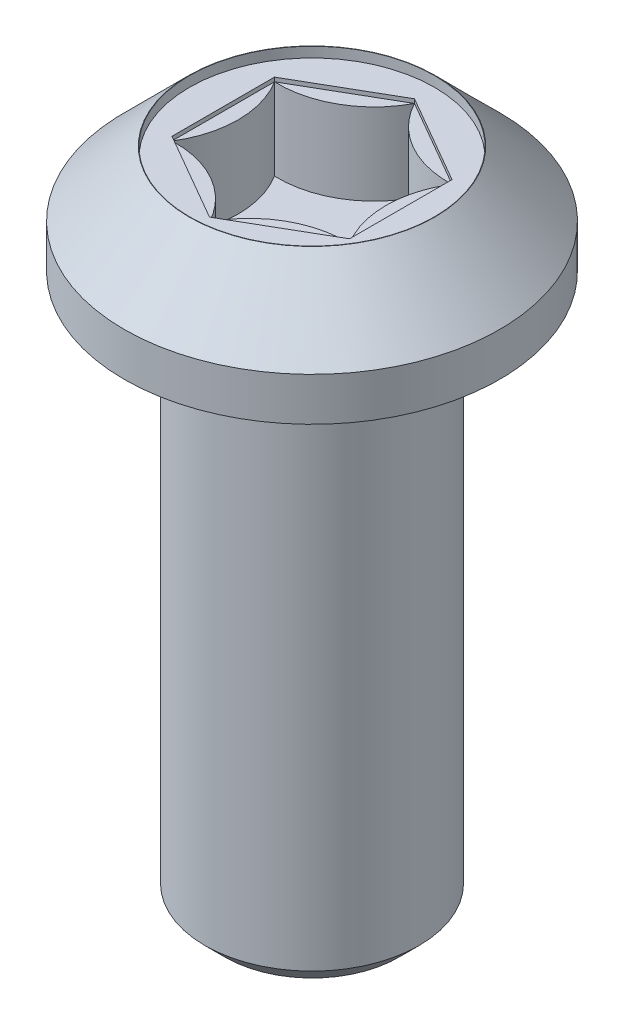
ISO-10303-21;
HEADER;
FILE_DESCRIPTION(('STEP AP214'),'2;1');
FILE_NAME('part.step','',(''),(''),'','','');
FILE_SCHEMA(('AUTOMOTIVE_DESIGN { 1 0 10303 214 1 1 1 1 }'));
ENDSEC;
DATA;
#1=APPLICATION_CONTEXT('core data for automotive mechanical design processes');
#2=APPLICATION_PROTOCOL_DEFINITION('international standard','automotive_design',2000,#1);
#3=PRODUCT_CONTEXT('',#1,'mechanical');
#4=PRODUCT('Part','Part','',(#3));
#5=PRODUCT_RELATED_PRODUCT_CATEGORY('part','',(#4));
#6=PRODUCT_DEFINITION_FORMATION('','',#4);
#7=PRODUCT_DEFINITION_CONTEXT('part definition',#1,'design');
#8=PRODUCT_DEFINITION('design','',#6,#7);
#9=PRODUCT_DEFINITION_SHAPE('','',#8);
#10=(LENGTH_UNIT() NAMED_UNIT(*) SI_UNIT(.MILLI.,.METRE.));
#11=(NAMED_UNIT(*) PLANE_ANGLE_UNIT() SI_UNIT($,.RADIAN.));
#12=(NAMED_UNIT(*) SI_UNIT($,.STERADIAN.) SOLID_ANGLE_UNIT());
#13=UNCERTAINTY_MEASURE_WITH_UNIT(LENGTH_MEASURE(1.E-05),#10,'distance_accuracy_value','');
#14=(GEOMETRIC_REPRESENTATION_CONTEXT(3) GLOBAL_UNCERTAINTY_ASSIGNED_CONTEXT((#13)) GLOBAL_UNIT_ASSIGNED_CONTEXT((#10,
#11,#12)) REPRESENTATION_CONTEXT('',''));
#15=CARTESIAN_POINT('',(0.,0.,0.));
#16=DIRECTION('',(0.,0.,1.));
#17=DIRECTION('',(1.,0.,0.));
#18=AXIS2_PLACEMENT_3D('',#15,#16,#17);
#19=CARTESIAN_POINT('',(4.175,27.6,-7.23131212160054));
#20=DIRECTION('',(0.,1.,0.));
#21=DIRECTION('',(0.,0.,1.));
#22=AXIS2_PLACEMENT_3D('',#19,#20,#21);
#23=CYLINDRICAL_SURFACE('',#22,4.72308162114541);
#24=CARTESIAN_POINT('',(4.175,31.6,-7.23131212160054));
#25=DIRECTION('',(0.,-1.,0.));
#26=DIRECTION('',(0.,0.,1.));
#27=AXIS2_PLACEMENT_3D('',#24,#25,#26);
#28=CIRCLE('',#27,4.72308162114541);
#29=CARTESIAN_POINT('',(4.35000000000035,31.6,-2.51147367097507));
#30=VERTEX_POINT('',#29);
#31=CARTESIAN_POINT('',(0.,31.6,-5.02294734195014));
#32=VERTEX_POINT('',#31);
#33=EDGE_CURVE('E127',#30,#32,#28,.T.);
#34=ORIENTED_EDGE('',*,*,#33,.T.);
#35=DIRECTION('',(0.,1.,0.));
#36=VECTOR('',#35,1.);
#37=CARTESIAN_POINT('',(0.,27.6,-5.02294734195014));
#38=LINE('',#37,#36);
#39=CARTESIAN_POINT('',(0.,27.6,-5.02294734195014));
#40=VERTEX_POINT('',#39);
#41=EDGE_CURVE('E126',#40,#32,#38,.T.);
#42=ORIENTED_EDGE('',*,*,#41,.F.);
#43=CARTESIAN_POINT('',(4.175,27.6,-7.23131212160054));
#44=DIRECTION('',(0.,-1.,0.));
#45=DIRECTION('',(0.,0.,1.));
#46=AXIS2_PLACEMENT_3D('',#43,#44,#45);
#47=CIRCLE('',#46,4.72308162114541);
#48=CARTESIAN_POINT('',(4.35000000000035,27.6,-2.51147367097507));
#49=VERTEX_POINT('',#48);
#50=EDGE_CURVE('E140',#49,#40,#47,.T.);
#51=ORIENTED_EDGE('',*,*,#50,.F.);
#52=DIRECTION('',(0.,1.,0.));
#53=VECTOR('',#52,1.);
#54=CARTESIAN_POINT('',(4.35000000000035,27.6,-2.51147367097507));
#55=LINE('',#54,#53);
#56=EDGE_CURVE('E40',#49,#30,#55,.T.);
#57=ORIENTED_EDGE('',*,*,#56,.T.);
#58=EDGE_LOOP('',(#34,#42,#51,#57));
#59=FACE_BOUND('',#58,.T.);
#60=ADVANCED_FACE('F16',(#59),#23,.T.);
#61=CARTESIAN_POINT('',(8.35000000000034,27.6,0.));
#62=DIRECTION('',(0.,1.,0.));
#63=DIRECTION('',(0.,0.,1.));
#64=AXIS2_PLACEMENT_3D('',#61,#62,#63);
#65=CYLINDRICAL_SURFACE('',#64,4.72308162114535);
#66=CARTESIAN_POINT('',(8.35000000000034,31.6,0.));
#67=DIRECTION('',(0.,-1.,0.));
#68=DIRECTION('',(0.,0.,1.));
#69=AXIS2_PLACEMENT_3D('',#66,#67,#68);
#70=CIRCLE('',#69,4.72308162114535);
#71=CARTESIAN_POINT('',(4.35000000000035,31.6,2.51147367097507));
#72=VERTEX_POINT('',#71);
#73=EDGE_CURVE('E138',#72,#30,#70,.T.);
#74=ORIENTED_EDGE('',*,*,#73,.T.);
#75=ORIENTED_EDGE('',*,*,#56,.F.);
#76=CARTESIAN_POINT('',(8.35000000000034,27.6,0.));
#77=DIRECTION('',(0.,-1.,0.));
#78=DIRECTION('',(0.,0.,1.));
#79=AXIS2_PLACEMENT_3D('',#76,#77,#78);
#80=CIRCLE('',#79,4.72308162114535);
#81=CARTESIAN_POINT('',(4.35000000000035,27.6,2.51147367097508));
#82=VERTEX_POINT('',#81);
#83=EDGE_CURVE('E113',#82,#49,#80,.T.);
#84=ORIENTED_EDGE('',*,*,#83,.F.);
#85=DIRECTION('',(0.,1.,0.));
#86=VECTOR('',#85,1.);
#87=CARTESIAN_POINT('',(4.35000000000035,27.6,2.51147367097508));
#88=LINE('',#87,#86);
#89=EDGE_CURVE('E104',#82,#72,#88,.T.);
#90=ORIENTED_EDGE('',*,*,#89,.T.);
#91=EDGE_LOOP('',(#74,#75,#84,#90));
#92=FACE_BOUND('',#91,.T.);
#93=ADVANCED_FACE('F187',(#92),#65,.T.);
#94=CARTESIAN_POINT('',(4.17500000000017,27.6,7.23131212160036));
#95=DIRECTION('',(0.,1.,0.));
#96=DIRECTION('',(0.,0.,1.));
#97=AXIS2_PLACEMENT_3D('',#94,#95,#96);
#98=CYLINDRICAL_SURFACE('',#97,4.72308162114535);
#99=CARTESIAN_POINT('',(4.17500000000017,31.6,7.23131212160036));
#100=DIRECTION('',(0.,-1.,0.));
#101=DIRECTION('',(0.,0.,1.));
#102=AXIS2_PLACEMENT_3D('',#99,#100,#101);
#103=CIRCLE('',#102,4.72308162114535);
#104=CARTESIAN_POINT('',(0.,31.6,5.02294734195014));
#105=VERTEX_POINT('',#104);
#106=EDGE_CURVE('E136',#105,#72,#103,.T.);
#107=ORIENTED_EDGE('',*,*,#106,.T.);
#108=ORIENTED_EDGE('',*,*,#89,.F.);
#109=CARTESIAN_POINT('',(4.17500000000017,27.6,7.23131212160036));
#110=DIRECTION('',(0.,-1.,0.));
#111=DIRECTION('',(0.,0.,1.));
#112=AXIS2_PLACEMENT_3D('',#109,#110,#111);
#113=CIRCLE('',#112,4.72308162114535);
#114=CARTESIAN_POINT('',(0.,27.6,5.02294734195014));
#115=VERTEX_POINT('',#114);
#116=EDGE_CURVE('E108',#115,#82,#113,.T.);
#117=ORIENTED_EDGE('',*,*,#116,.F.);
#118=DIRECTION('',(0.,1.,0.));
#119=VECTOR('',#118,1.);
#120=CARTESIAN_POINT('',(0.,27.6,5.02294734195014));
#121=LINE('',#120,#119);
#122=EDGE_CURVE('E92',#115,#105,#121,.T.);
#123=ORIENTED_EDGE('',*,*,#122,.T.);
#124=EDGE_LOOP('',(#107,#108,#117,#123));
#125=FACE_BOUND('',#124,.T.);
#126=ADVANCED_FACE('F109',(#125),#98,.T.);
#127=CARTESIAN_POINT('',(-4.17500000000017,27.6,7.23131212160036));
#128=DIRECTION('',(0.,1.,0.));
#129=DIRECTION('',(0.,0.,1.));
#130=AXIS2_PLACEMENT_3D('',#127,#128,#129);
#131=CYLINDRICAL_SURFACE('',#130,4.72308162114535);
#132=CARTESIAN_POINT('',(-4.17500000000017,31.6,7.23131212160036));
#133=DIRECTION('',(0.,-1.,0.));
#134=DIRECTION('',(0.,0.,1.));
#135=AXIS2_PLACEMENT_3D('',#132,#133,#134);
#136=CIRCLE('',#135,4.72308162114535);
#137=CARTESIAN_POINT('',(-4.35000000000034,31.6,2.51147367097507));
#138=VERTEX_POINT('',#137);
#139=EDGE_CURVE('E101',#138,#105,#136,.T.);
#140=ORIENTED_EDGE('',*,*,#139,.T.);
#141=ORIENTED_EDGE('',*,*,#122,.F.);
#142=CARTESIAN_POINT('',(-4.17500000000017,27.6,7.23131212160036));
#143=DIRECTION('',(0.,-1.,0.));
#144=DIRECTION('',(0.,0.,1.));
#145=AXIS2_PLACEMENT_3D('',#142,#143,#144);
#146=CIRCLE('',#145,4.72308162114535);
#147=CARTESIAN_POINT('',(-4.35000000000034,27.6,2.51147367097507));
#148=VERTEX_POINT('',#147);
#149=EDGE_CURVE('E97',#148,#115,#146,.T.);
#150=ORIENTED_EDGE('',*,*,#149,.F.);
#151=DIRECTION('',(0.,1.,0.));
#152=VECTOR('',#151,1.);
#153=CARTESIAN_POINT('',(-4.35000000000034,27.6,2.51147367097507));
#154=LINE('',#153,#152);
#155=EDGE_CURVE('E105',#148,#138,#154,.T.);
#156=ORIENTED_EDGE('',*,*,#155,.T.);
#157=EDGE_LOOP('',(#140,#141,#150,#156));
#158=FACE_BOUND('',#157,.T.);
#159=ADVANCED_FACE('F94',(#158),#131,.T.);
#160=CARTESIAN_POINT('',(-8.35000000000034,27.6,0.));
#161=DIRECTION('',(0.,1.,0.));
#162=DIRECTION('',(0.,0.,1.));
#163=AXIS2_PLACEMENT_3D('',#160,#161,#162);
#164=CYLINDRICAL_SURFACE('',#163,4.72308162114535);
#165=CARTESIAN_POINT('',(-8.35000000000034,31.6,0.));
#166=DIRECTION('',(0.,-1.,0.));
#167=DIRECTION('',(0.,0.,1.));
#168=AXIS2_PLACEMENT_3D('',#165,#166,#167);
#169=CIRCLE('',#168,4.72308162114535);
#170=CARTESIAN_POINT('',(-4.35000000000035,31.6,-2.51147367097507));
#171=VERTEX_POINT('',#170);
#172=EDGE_CURVE('E132',#171,#138,#169,.T.);
#173=ORIENTED_EDGE('',*,*,#172,.T.);
#174=ORIENTED_EDGE('',*,*,#155,.F.);
#175=CARTESIAN_POINT('',(-8.35000000000034,27.6,0.));
#176=DIRECTION('',(0.,-1.,0.));
#177=DIRECTION('',(0.,0.,1.));
#178=AXIS2_PLACEMENT_3D('',#175,#176,#177);
#179=CIRCLE('',#178,4.72308162114535);
#180=CARTESIAN_POINT('',(-4.35000000000035,27.6,-2.51147367097507));
#181=VERTEX_POINT('',#180);
#182=EDGE_CURVE('E119',#181,#148,#179,.T.);
#183=ORIENTED_EDGE('',*,*,#182,.F.);
#184=DIRECTION('',(0.,1.,0.));
#185=VECTOR('',#184,1.);
#186=CARTESIAN_POINT('',(-4.35000000000035,27.6,-2.51147367097507));
#187=LINE('',#186,#185);
#188=EDGE_CURVE('E145',#181,#171,#187,.T.);
#189=ORIENTED_EDGE('',*,*,#188,.T.);
#190=EDGE_LOOP('',(#173,#174,#183,#189));
#191=FACE_BOUND('',#190,.T.);
#192=ADVANCED_FACE('F422',(#191),#164,.T.);
#193=CARTESIAN_POINT('',(-4.17500000000017,27.6,-7.23131212160036));
#194=DIRECTION('',(0.,1.,0.));
#195=DIRECTION('',(0.,0.,1.));
#196=AXIS2_PLACEMENT_3D('',#193,#194,#195);
#197=CYLINDRICAL_SURFACE('',#196,4.72308162114535);
#198=CARTESIAN_POINT('',(-4.17500000000017,31.6,-7.23131212160036));
#199=DIRECTION('',(0.,-1.,0.));
#200=DIRECTION('',(0.,0.,1.));
#201=AXIS2_PLACEMENT_3D('',#198,#199,#200);
#202=CIRCLE('',#201,4.72308162114535);
#203=EDGE_CURVE('E61',#32,#171,#202,.T.);
#204=ORIENTED_EDGE('',*,*,#203,.T.);
#205=ORIENTED_EDGE('',*,*,#188,.F.);
#206=CARTESIAN_POINT('',(-4.17500000000017,27.6,-7.23131212160036));
#207=DIRECTION('',(0.,-1.,0.));
#208=DIRECTION('',(0.,0.,1.));
#209=AXIS2_PLACEMENT_3D('',#206,#207,#208);
#210=CIRCLE('',#209,4.72308162114535);
#211=EDGE_CURVE('E121',#40,#181,#210,.T.);
#212=ORIENTED_EDGE('',*,*,#211,.F.);
#213=ORIENTED_EDGE('',*,*,#41,.T.);
#214=EDGE_LOOP('',(#204,#205,#212,#213));
#215=FACE_BOUND('',#214,.T.);
#216=ADVANCED_FACE('F197',(#215),#197,.T.);
#217=CARTESIAN_POINT('',(6.26250000000017,27.6,-3.61565606080027));
#218=DIRECTION('',(0.,1.,0.));
#219=DIRECTION('',(0.,0.,1.));
#220=AXIS2_PLACEMENT_3D('',#217,#218,#219);
#221=PLANE('',#220);
#222=ORIENTED_EDGE('',*,*,#50,.T.);
#223=ORIENTED_EDGE('',*,*,#211,.T.);
#224=ORIENTED_EDGE('',*,*,#182,.T.);
#225=ORIENTED_EDGE('',*,*,#149,.T.);
#226=ORIENTED_EDGE('',*,*,#116,.T.);
#227=ORIENTED_EDGE('',*,*,#83,.T.);
#228=EDGE_LOOP('',(#222,#223,#224,#225,#226,#227));
#229=FACE_BOUND('',#228,.T.);
#230=ADVANCED_FACE('F116',(#229),#221,.T.);
#231=CARTESIAN_POINT('',(0.,31.6,0.));
#232=DIRECTION('',(0.,1.,0.));
#233=DIRECTION('',(0.,0.,1.));
#234=AXIS2_PLACEMENT_3D('',#231,#232,#233);
#235=PLANE('',#234);
#236=DIRECTION('',(-0.866025403784439,0.,-0.5));
#237=VECTOR('',#236,1.);
#238=CARTESIAN_POINT('',(4.35000000000035,31.6,-2.51147367097507));
#239=LINE('',#238,#237);
#240=EDGE_CURVE('E481',#30,#32,#239,.T.);
#241=ORIENTED_EDGE('',*,*,#240,.T.);
#242=ORIENTED_EDGE('',*,*,#33,.F.);
#243=EDGE_LOOP('',(#241,#242));
#244=FACE_BOUND('',#243,.T.);
#245=ADVANCED_FACE('F317',(#244),#235,.T.);
#246=DIRECTION('',(0.,0.,-1.));
#247=VECTOR('',#246,1.);
#248=CARTESIAN_POINT('',(4.35000000000035,31.6,2.51147367097507));
#249=LINE('',#248,#247);
#250=EDGE_CURVE('E478',#72,#30,#249,.T.);
#251=ORIENTED_EDGE('',*,*,#250,.T.);
#252=ORIENTED_EDGE('',*,*,#73,.F.);
#253=EDGE_LOOP('',(#251,#252));
#254=FACE_BOUND('',#253,.T.);
#255=ADVANCED_FACE('F392',(#254),#235,.T.);
#256=DIRECTION('',(0.866025403784439,0.,-0.5));
#257=VECTOR('',#256,1.);
#258=CARTESIAN_POINT('',(0.,31.6,5.02294734195014));
#259=LINE('',#258,#257);
#260=EDGE_CURVE('E470',#105,#72,#259,.T.);
#261=ORIENTED_EDGE('',*,*,#260,.T.);
#262=ORIENTED_EDGE('',*,*,#106,.F.);
#263=EDGE_LOOP('',(#261,#262));
#264=FACE_BOUND('',#263,.T.);
#265=ADVANCED_FACE('F384',(#264),#235,.T.);
#266=DIRECTION('',(0.866025403784439,0.,0.5));
#267=VECTOR('',#266,1.);
#268=CARTESIAN_POINT('',(-4.35000000000034,31.6,2.51147367097507));
#269=LINE('',#268,#267);
#270=EDGE_CURVE('E466',#138,#105,#269,.T.);
#271=ORIENTED_EDGE('',*,*,#270,.T.);
#272=ORIENTED_EDGE('',*,*,#139,.F.);
#273=EDGE_LOOP('',(#271,#272));
#274=FACE_BOUND('',#273,.T.);
#275=ADVANCED_FACE('F376',(#274),#235,.T.);
#276=DIRECTION('',(0.,0.,1.));
#277=VECTOR('',#276,1.);
#278=CARTESIAN_POINT('',(-4.35000000000035,31.6,-2.51147367097507));
#279=LINE('',#278,#277);
#280=EDGE_CURVE('E464',#171,#138,#279,.T.);
#281=ORIENTED_EDGE('',*,*,#280,.T.);
#282=ORIENTED_EDGE('',*,*,#172,.F.);
#283=EDGE_LOOP('',(#281,#282));
#284=FACE_BOUND('',#283,.T.);
#285=ADVANCED_FACE('F318',(#284),#235,.T.);
#286=CARTESIAN_POINT('',(-4.35000000000035,31.6,-2.51147367097507));
#287=DIRECTION('',(-1.,0.,0.));
#288=DIRECTION('',(0.,0.,1.));
#289=AXIS2_PLACEMENT_3D('',#286,#287,#288);
#290=PLANE('',#289);
#291=DIRECTION('',(0.,0.,1.));
#292=VECTOR('',#291,1.);
#293=CARTESIAN_POINT('',(-4.35000000000035,31.8,-2.51147367097507));
#294=LINE('',#293,#292);
#295=CARTESIAN_POINT('',(-4.35000000000035,31.8,-2.51147367097507));
#296=VERTEX_POINT('',#295);
#297=CARTESIAN_POINT('',(-4.35000000000034,31.8,2.51147367097507));
#298=VERTEX_POINT('',#297);
#299=EDGE_CURVE('E31',#296,#298,#294,.T.);
#300=ORIENTED_EDGE('',*,*,#299,.T.);
#301=DIRECTION('',(0.,1.,0.));
#302=VECTOR('',#301,1.);
#303=CARTESIAN_POINT('',(-4.35000000000034,31.6,2.51147367097507));
#304=LINE('',#303,#302);
#305=EDGE_CURVE('E485',#138,#298,#304,.T.);
#306=ORIENTED_EDGE('',*,*,#305,.F.);
#307=ORIENTED_EDGE('',*,*,#280,.F.);
#308=DIRECTION('',(0.,1.,0.));
#309=VECTOR('',#308,1.);
#310=CARTESIAN_POINT('',(-4.35000000000035,31.6,-2.51147367097507));
#311=LINE('',#310,#309);
#312=EDGE_CURVE('E130',#171,#296,#311,.T.);
#313=ORIENTED_EDGE('',*,*,#312,.T.);
#314=EDGE_LOOP('',(#300,#306,#307,#313));
#315=FACE_BOUND('',#314,.T.);
#316=ADVANCED_FACE('F360',(#315),#290,.F.);
#317=CARTESIAN_POINT('',(0.,31.6,-5.02294734195014));
#318=DIRECTION('',(-0.499999999999999,0.,-0.866025403784439));
#319=DIRECTION('',(-0.866025403784439,0.,0.499999999999999));
#320=AXIS2_PLACEMENT_3D('',#317,#318,#319);
#321=PLANE('',#320);
#322=DIRECTION('',(-0.866025403784439,0.,0.499999999999999));
#323=VECTOR('',#322,1.);
#324=CARTESIAN_POINT('',(0.,31.8,-5.02294734195014));
#325=LINE('',#324,#323);
#326=CARTESIAN_POINT('',(0.,31.8,-5.02294734195014));
#327=VERTEX_POINT('',#326);
#328=EDGE_CURVE('E467',#327,#296,#325,.T.);
#329=ORIENTED_EDGE('',*,*,#328,.T.);
#330=ORIENTED_EDGE('',*,*,#312,.F.);
#331=DIRECTION('',(-0.866025403784439,0.,0.499999999999999));
#332=VECTOR('',#331,1.);
#333=CARTESIAN_POINT('',(0.,31.6,-5.02294734195014));
#334=LINE('',#333,#332);
#335=EDGE_CURVE('E53',#32,#171,#334,.T.);
#336=ORIENTED_EDGE('',*,*,#335,.F.);
#337=DIRECTION('',(0.,1.,0.));
#338=VECTOR('',#337,1.);
#339=CARTESIAN_POINT('',(0.,31.6,-5.02294734195014));
#340=LINE('',#339,#338);
#341=EDGE_CURVE('E499',#32,#327,#340,.T.);
#342=ORIENTED_EDGE('',*,*,#341,.T.);
#343=EDGE_LOOP('',(#329,#330,#336,#342));
#344=FACE_BOUND('',#343,.T.);
#345=ADVANCED_FACE('F351',(#344),#321,.F.);
#346=CARTESIAN_POINT('',(4.35000000000035,31.6,-2.51147367097507));
#347=DIRECTION('',(0.5,0.,-0.866025403784439));
#348=DIRECTION('',(-0.866025403784439,0.,-0.5));
#349=AXIS2_PLACEMENT_3D('',#346,#347,#348);
#350=PLANE('',#349);
#351=DIRECTION('',(-0.866025403784439,0.,-0.5));
#352=VECTOR('',#351,1.);
#353=CARTESIAN_POINT('',(4.35000000000035,31.8,-2.51147367097507));
#354=LINE('',#353,#352);
#355=CARTESIAN_POINT('',(4.35000000000035,31.8,-2.51147367097507));
#356=VERTEX_POINT('',#355);
#357=EDGE_CURVE('E473',#356,#327,#354,.T.);
#358=ORIENTED_EDGE('',*,*,#357,.T.);
#359=ORIENTED_EDGE('',*,*,#341,.F.);
#360=ORIENTED_EDGE('',*,*,#240,.F.);
#361=DIRECTION('',(0.,1.,0.));
#362=VECTOR('',#361,1.);
#363=CARTESIAN_POINT('',(4.35000000000035,31.6,-2.51147367097507));
#364=LINE('',#363,#362);
#365=EDGE_CURVE('E501',#30,#356,#364,.T.);
#366=ORIENTED_EDGE('',*,*,#365,.T.);
#367=EDGE_LOOP('',(#358,#359,#360,#366));
#368=FACE_BOUND('',#367,.T.);
#369=ADVANCED_FACE('F342',(#368),#350,.F.);
#370=CARTESIAN_POINT('',(4.35000000000035,31.6,2.51147367097507));
#371=DIRECTION('',(1.,0.,0.));
#372=DIRECTION('',(0.,0.,-1.));
#373=AXIS2_PLACEMENT_3D('',#370,#371,#372);
#374=PLANE('',#373);
#375=DIRECTION('',(0.,0.,-1.));
#376=VECTOR('',#375,1.);
#377=CARTESIAN_POINT('',(4.35000000000035,31.8,2.51147367097507));
#378=LINE('',#377,#376);
#379=CARTESIAN_POINT('',(4.35000000000035,31.8,2.51147367097507));
#380=VERTEX_POINT('',#379);
#381=EDGE_CURVE('E493',#380,#356,#378,.T.);
#382=ORIENTED_EDGE('',*,*,#381,.T.);
#383=ORIENTED_EDGE('',*,*,#365,.F.);
#384=ORIENTED_EDGE('',*,*,#250,.F.);
#385=DIRECTION('',(0.,1.,0.));
#386=VECTOR('',#385,1.);
#387=CARTESIAN_POINT('',(4.35000000000035,31.6,2.51147367097507));
#388=LINE('',#387,#386);
#389=EDGE_CURVE('E503',#72,#380,#388,.T.);
#390=ORIENTED_EDGE('',*,*,#389,.T.);
#391=EDGE_LOOP('',(#382,#383,#384,#390));
#392=FACE_BOUND('',#391,.T.);
#393=ADVANCED_FACE('F333',(#392),#374,.F.);
#394=CARTESIAN_POINT('',(0.,31.6,5.02294734195014));
#395=DIRECTION('',(0.5,0.,0.866025403784439));
#396=DIRECTION('',(0.866025403784439,0.,-0.5));
#397=AXIS2_PLACEMENT_3D('',#394,#395,#396);
#398=PLANE('',#397);
#399=DIRECTION('',(0.866025403784439,0.,-0.5));
#400=VECTOR('',#399,1.);
#401=CARTESIAN_POINT('',(0.,31.8,5.02294734195014));
#402=LINE('',#401,#400);
#403=CARTESIAN_POINT('',(0.,31.8,5.02294734195014));
#404=VERTEX_POINT('',#403);
#405=EDGE_CURVE('E490',#404,#380,#402,.T.);
#406=ORIENTED_EDGE('',*,*,#405,.T.);
#407=ORIENTED_EDGE('',*,*,#389,.F.);
#408=ORIENTED_EDGE('',*,*,#260,.F.);
#409=DIRECTION('',(0.,1.,0.));
#410=VECTOR('',#409,1.);
#411=CARTESIAN_POINT('',(0.,31.6,5.02294734195014));
#412=LINE('',#411,#410);
#413=EDGE_CURVE('E505',#105,#404,#412,.T.);
#414=ORIENTED_EDGE('',*,*,#413,.T.);
#415=EDGE_LOOP('',(#406,#407,#408,#414));
#416=FACE_BOUND('',#415,.T.);
#417=ADVANCED_FACE('F324',(#416),#398,.F.);
#418=CARTESIAN_POINT('',(-4.35000000000034,31.6,2.51147367097507));
#419=DIRECTION('',(-0.5,0.,0.866025403784439));
#420=DIRECTION('',(0.866025403784439,0.,0.5));
#421=AXIS2_PLACEMENT_3D('',#418,#419,#420);
#422=PLANE('',#421);
#423=DIRECTION('',(0.866025403784439,0.,0.5));
#424=VECTOR('',#423,1.);
#425=CARTESIAN_POINT('',(-4.35000000000034,31.8,2.51147367097507));
#426=LINE('',#425,#424);
#427=EDGE_CURVE('E487',#298,#404,#426,.T.);
#428=ORIENTED_EDGE('',*,*,#427,.T.);
#429=ORIENTED_EDGE('',*,*,#413,.F.);
#430=ORIENTED_EDGE('',*,*,#270,.F.);
#431=ORIENTED_EDGE('',*,*,#305,.T.);
#432=EDGE_LOOP('',(#428,#429,#430,#431));
#433=FACE_BOUND('',#432,.T.);
#434=ADVANCED_FACE('F315',(#433),#422,.F.);
#435=ORIENTED_EDGE('',*,*,#335,.T.);
#436=ORIENTED_EDGE('',*,*,#203,.F.);
#437=EDGE_LOOP('',(#435,#436));
#438=FACE_BOUND('',#437,.T.);
#439=ADVANCED_FACE('F225',(#438),#235,.T.);
#440=CARTESIAN_POINT('',(0.,27.,0.));
#441=DIRECTION('',(0.,-1.,0.));
#442=DIRECTION('',(0.,0.,-1.));
#443=AXIS2_PLACEMENT_3D('',#440,#441,#442);
#444=CYLINDRICAL_SURFACE('',#443,5.25);
#445=CARTESIAN_POINT('',(0.,1.00000000000001,0.));
#446=DIRECTION('',(0.,1.,0.));
#447=DIRECTION('',(0.,0.,1.));
#448=AXIS2_PLACEMENT_3D('',#445,#446,#447);
#449=CIRCLE('',#448,5.25);
#450=CARTESIAN_POINT('',(0.,1.00000000000001,5.25));
#451=VERTEX_POINT('',#450);
#452=EDGE_CURVE('E24',#451,#451,#449,.T.);
#453=ORIENTED_EDGE('',*,*,#452,.T.);
#454=EDGE_LOOP('',(#453));
#455=FACE_BOUND('',#454,.T.);
#456=CARTESIAN_POINT('',(0.,26.,0.));
#457=DIRECTION('',(0.,1.,0.));
#458=DIRECTION('',(0.,0.,1.));
#459=AXIS2_PLACEMENT_3D('',#456,#457,#458);
#460=CIRCLE('',#459,5.25);
#461=CARTESIAN_POINT('',(0.,26.,5.25));
#462=VERTEX_POINT('',#461);
#463=EDGE_CURVE('E161',#462,#462,#460,.F.);
#464=ORIENTED_EDGE('',*,*,#463,.T.);
#465=EDGE_LOOP('',(#464));
#466=FACE_BOUND('',#465,.T.);
#467=ADVANCED_FACE('F172',(#455,#466),#444,.T.);
#468=CARTESIAN_POINT('',(0.,0.,0.));
#469=DIRECTION('',(0.,1.,0.));
#470=DIRECTION('',(0.,0.,1.));
#471=AXIS2_PLACEMENT_3D('',#468,#469,#470);
#472=PLANE('',#471);
#473=CARTESIAN_POINT('',(0.,0.,0.));
#474=DIRECTION('',(0.,1.,0.));
#475=DIRECTION('',(0.,0.,1.));
#476=AXIS2_PLACEMENT_3D('',#473,#474,#475);
#477=CIRCLE('',#476,4.24999999999999);
#478=CARTESIAN_POINT('',(0.,0.,4.24999999999999));
#479=VERTEX_POINT('',#478);
#480=EDGE_CURVE('E10',#479,#479,#477,.F.);
#481=ORIENTED_EDGE('',*,*,#480,.T.);
#482=EDGE_LOOP('',(#481));
#483=FACE_BOUND('',#482,.T.);
#484=ADVANCED_FACE('F215',(#483),#472,.F.);
#485=CARTESIAN_POINT('',(0.,27.,0.));
#486=DIRECTION('',(0.,1.,0.));
#487=DIRECTION('',(0.,0.,1.));
#488=AXIS2_PLACEMENT_3D('',#485,#486,#487);
#489=PLANE('',#488);
#490=CARTESIAN_POINT('',(0.,27.,0.));
#491=DIRECTION('',(0.,1.,0.));
#492=DIRECTION('',(0.,0.,1.));
#493=AXIS2_PLACEMENT_3D('',#490,#491,#492);
#494=CIRCLE('',#493,6.25);
#495=CARTESIAN_POINT('',(0.,27.,6.25));
#496=VERTEX_POINT('',#495);
#497=EDGE_CURVE('E158',#496,#496,#494,.T.);
#498=ORIENTED_EDGE('',*,*,#497,.T.);
#499=EDGE_LOOP('',(#498));
#500=FACE_BOUND('',#499,.T.);
#501=CARTESIAN_POINT('',(0.,27.,0.));
#502=DIRECTION('',(0.,1.,0.));
#503=DIRECTION('',(0.,0.,1.));
#504=AXIS2_PLACEMENT_3D('',#501,#502,#503);
#505=CIRCLE('',#504,9.2);
#506=CARTESIAN_POINT('',(0.,27.,9.2));
#507=VERTEX_POINT('',#506);
#508=EDGE_CURVE('E153',#507,#507,#505,.T.);
#509=ORIENTED_EDGE('',*,*,#508,.F.);
#510=EDGE_LOOP('',(#509));
#511=FACE_BOUND('',#510,.T.);
#512=ADVANCED_FACE('F212',(#500,#511),#489,.F.);
#513=CARTESIAN_POINT('',(0.,32.3,0.));
#514=DIRECTION('',(0.,-1.,0.));
#515=DIRECTION('',(0.,0.,-1.));
#516=AXIS2_PLACEMENT_3D('',#513,#514,#515);
#517=CYLINDRICAL_SURFACE('',#516,9.2);
#518=CARTESIAN_POINT('',(0.,29.12,0.));
#519=DIRECTION('',(0.,1.,0.));
#520=DIRECTION('',(0.,0.,1.));
#521=AXIS2_PLACEMENT_3D('',#518,#519,#520);
#522=CIRCLE('',#521,9.2);
#523=CARTESIAN_POINT('',(0.,29.12,9.2));
#524=VERTEX_POINT('',#523);
#525=EDGE_CURVE('E167',#524,#524,#522,.F.);
#526=ORIENTED_EDGE('',*,*,#525,.T.);
#527=EDGE_LOOP('',(#526));
#528=FACE_BOUND('',#527,.T.);
#529=ORIENTED_EDGE('',*,*,#508,.T.);
#530=EDGE_LOOP('',(#529));
#531=FACE_BOUND('',#530,.T.);
#532=ADVANCED_FACE('F210',(#528,#531),#517,.T.);
#533=CARTESIAN_POINT('',(0.,32.3,0.));
#534=DIRECTION('',(0.,1.,0.));
#535=DIRECTION('',(0.,0.,1.));
#536=AXIS2_PLACEMENT_3D('',#533,#534,#535);
#537=PLANE('',#536);
#538=CARTESIAN_POINT('',(0.,32.3,0.));
#539=DIRECTION('',(0.,1.,0.));
#540=DIRECTION('',(0.,0.,1.));
#541=AXIS2_PLACEMENT_3D('',#538,#539,#540);
#542=CIRCLE('',#541,6.02);
#543=CARTESIAN_POINT('',(0.,32.3,6.02));
#544=VERTEX_POINT('',#543);
#545=EDGE_CURVE('E164',#544,#544,#542,.T.);
#546=ORIENTED_EDGE('',*,*,#545,.T.);
#547=EDGE_LOOP('',(#546));
#548=FACE_BOUND('',#547,.T.);
#549=CARTESIAN_POINT('',(0.,32.3,0.));
#550=DIRECTION('',(0.,1.,0.));
#551=DIRECTION('',(0.,0.,1.));
#552=AXIS2_PLACEMENT_3D('',#549,#550,#551);
#553=CIRCLE('',#552,6.);
#554=CARTESIAN_POINT('',(0.,32.3,6.));
#555=VERTEX_POINT('',#554);
#556=EDGE_CURVE('E142',#555,#555,#553,.T.);
#557=ORIENTED_EDGE('',*,*,#556,.F.);
#558=EDGE_LOOP('',(#557));
#559=FACE_BOUND('',#558,.T.);
#560=ADVANCED_FACE('F206',(#548,#559),#537,.T.);
#561=CARTESIAN_POINT('',(0.,31.8,0.));
#562=DIRECTION('',(0.,1.,0.));
#563=DIRECTION('',(0.,0.,1.));
#564=AXIS2_PLACEMENT_3D('',#561,#562,#563);
#565=CYLINDRICAL_SURFACE('',#564,6.);
#566=CARTESIAN_POINT('',(0.,31.8,0.));
#567=DIRECTION('',(0.,1.,0.));
#568=DIRECTION('',(0.,0.,1.));
#569=AXIS2_PLACEMENT_3D('',#566,#567,#568);
#570=CIRCLE('',#569,6.);
#571=CARTESIAN_POINT('',(0.,31.8,6.));
#572=VERTEX_POINT('',#571);
#573=EDGE_CURVE('E150',#572,#572,#570,.T.);
#574=ORIENTED_EDGE('',*,*,#573,.F.);
#575=EDGE_LOOP('',(#574));
#576=FACE_BOUND('',#575,.T.);
#577=ORIENTED_EDGE('',*,*,#556,.T.);
#578=EDGE_LOOP('',(#577));
#579=FACE_BOUND('',#578,.T.);
#580=ADVANCED_FACE('F202',(#576,#579),#565,.F.);
#581=CARTESIAN_POINT('',(0.,31.8,0.));
#582=DIRECTION('',(0.,1.,0.));
#583=DIRECTION('',(0.,0.,1.));
#584=AXIS2_PLACEMENT_3D('',#581,#582,#583);
#585=PLANE('',#584);
#586=ORIENTED_EDGE('',*,*,#299,.F.);
#587=ORIENTED_EDGE('',*,*,#328,.F.);
#588=ORIENTED_EDGE('',*,*,#357,.F.);
#589=ORIENTED_EDGE('',*,*,#381,.F.);
#590=ORIENTED_EDGE('',*,*,#405,.F.);
#591=ORIENTED_EDGE('',*,*,#427,.F.);
#592=EDGE_LOOP('',(#586,#587,#588,#589,#590,#591));
#593=FACE_BOUND('',#592,.T.);
#594=ORIENTED_EDGE('',*,*,#573,.T.);
#595=EDGE_LOOP('',(#594));
#596=FACE_BOUND('',#595,.T.);
#597=ADVANCED_FACE('F199',(#593,#596),#585,.T.);
#598=CARTESIAN_POINT('',(0.,26.,0.));
#599=DIRECTION('',(0.,1.,0.));
#600=DIRECTION('',(0.,0.,1.));
#601=AXIS2_PLACEMENT_3D('',#598,#599,#600);
#602=TOROIDAL_SURFACE('',#601,6.25,1.);
#603=ORIENTED_EDGE('',*,*,#463,.F.);
#604=EDGE_LOOP('',(#603));
#605=FACE_BOUND('',#604,.T.);
#606=ORIENTED_EDGE('',*,*,#497,.F.);
#607=EDGE_LOOP('',(#606));
#608=FACE_BOUND('',#607,.T.);
#609=ADVANCED_FACE('F183',(#605,#608),#602,.F.);
#610=CARTESIAN_POINT('',(0.,32.3,0.));
#611=DIRECTION('',(0.,-1.,0.));
#612=DIRECTION('',(0.,0.,-1.));
#613=AXIS2_PLACEMENT_3D('',#610,#611,#612);
#614=CONICAL_SURFACE('',#613,6.02,0.785398163397446);
#615=ORIENTED_EDGE('',*,*,#525,.F.);
#616=EDGE_LOOP('',(#615));
#617=FACE_BOUND('',#616,.T.);
#618=ORIENTED_EDGE('',*,*,#545,.F.);
#619=EDGE_LOOP('',(#618));
#620=FACE_BOUND('',#619,.T.);
#621=ADVANCED_FACE('F176',(#617,#620),#614,.T.);
#622=CARTESIAN_POINT('',(0.,1.00000000000001,0.));
#623=DIRECTION('',(0.,1.,0.));
#624=DIRECTION('',(0.,0.,1.));
#625=AXIS2_PLACEMENT_3D('',#622,#623,#624);
#626=CONICAL_SURFACE('',#625,5.25,0.785398163397451);
#627=ORIENTED_EDGE('',*,*,#480,.F.);
#628=EDGE_LOOP('',(#627));
#629=FACE_BOUND('',#628,.T.);
#630=ORIENTED_EDGE('',*,*,#452,.F.);
#631=EDGE_LOOP('',(#630));
#632=FACE_BOUND('',#631,.T.);
#633=ADVANCED_FACE('F18',(#629,#632),#626,.T.);
#634=CLOSED_SHELL('',(#60,#93,#126,#159,#192,#216,#230,#245,#255,#265,#275,#285,#316,#345,#369,
#393,#417,#434,#439,#467,#484,#512,#532,#560,#580,#597,#609,#621,#633));
#635=MANIFOLD_SOLID_BREP('B1',#634);
#636=ADVANCED_BREP_SHAPE_REPRESENTATION('',(#18,#635),#14);
#637=SHAPE_DEFINITION_REPRESENTATION(#9,#636);
ENDSEC;
END-ISO-10303-21;
